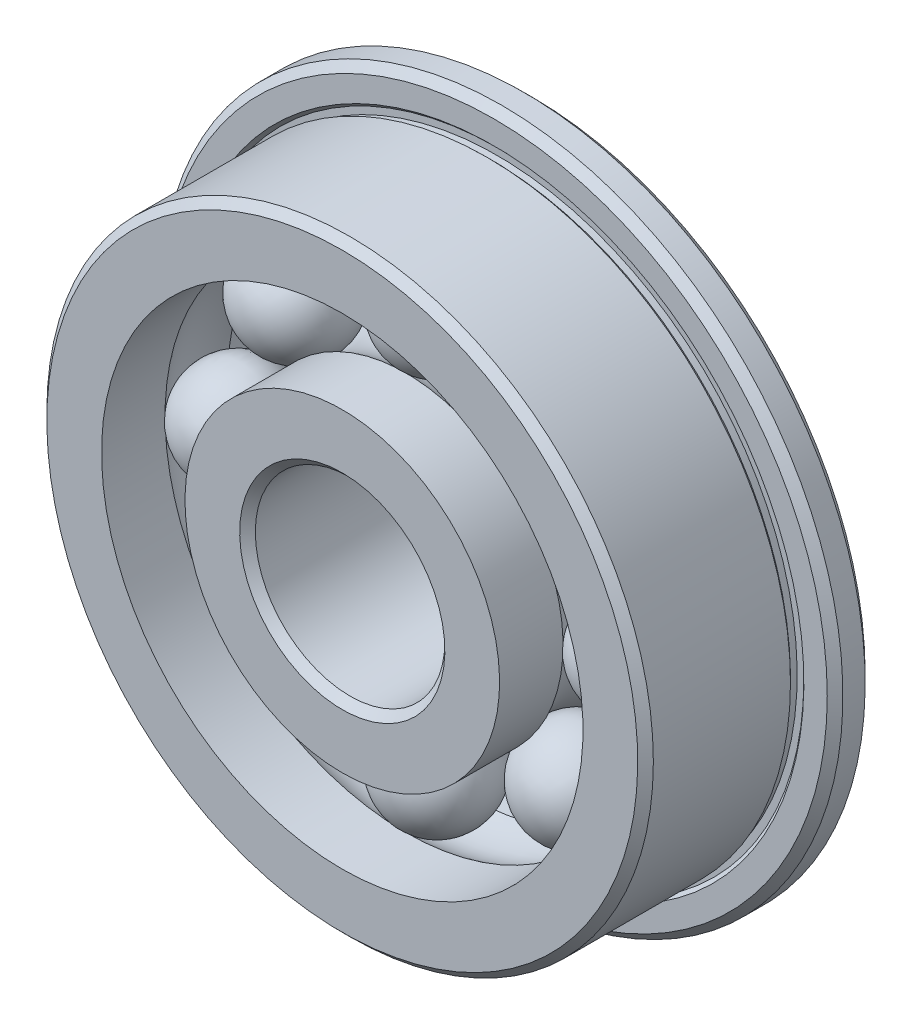
ISO-10303-21;
HEADER;
FILE_DESCRIPTION(('STEP AP214'),'2;1');
FILE_NAME('part.step','',(''),(''),'','','');
FILE_SCHEMA(('AUTOMOTIVE_DESIGN { 1 0 10303 214 1 1 1 1 }'));
ENDSEC;
DATA;
#1=APPLICATION_CONTEXT('core data for automotive mechanical design processes');
#2=APPLICATION_PROTOCOL_DEFINITION('international standard','automotive_design',2000,#1);
#3=PRODUCT_CONTEXT('',#1,'mechanical');
#4=PRODUCT('Part','Part','',(#3));
#5=PRODUCT_RELATED_PRODUCT_CATEGORY('part','',(#4));
#6=PRODUCT_DEFINITION_FORMATION('','',#4);
#7=PRODUCT_DEFINITION_CONTEXT('part definition',#1,'design');
#8=PRODUCT_DEFINITION('design','',#6,#7);
#9=PRODUCT_DEFINITION_SHAPE('','',#8);
#10=(LENGTH_UNIT() NAMED_UNIT(*) SI_UNIT(.MILLI.,.METRE.));
#11=(NAMED_UNIT(*) PLANE_ANGLE_UNIT() SI_UNIT($,.RADIAN.));
#12=(NAMED_UNIT(*) SI_UNIT($,.STERADIAN.) SOLID_ANGLE_UNIT());
#13=UNCERTAINTY_MEASURE_WITH_UNIT(LENGTH_MEASURE(1.E-05),#10,'distance_accuracy_value','');
#14=(GEOMETRIC_REPRESENTATION_CONTEXT(3) GLOBAL_UNCERTAINTY_ASSIGNED_CONTEXT((#13)) GLOBAL_UNIT_ASSIGNED_CONTEXT((#10,
#11,#12)) REPRESENTATION_CONTEXT('',''));
#15=CARTESIAN_POINT('',(0.,0.,0.));
#16=DIRECTION('',(0.,0.,1.));
#17=DIRECTION('',(1.,0.,0.));
#18=AXIS2_PLACEMENT_3D('',#15,#16,#17);
#19=CARTESIAN_POINT('',(-3.71231060122933,3.71231060122942,0.));
#20=DIRECTION('',(-0.707106781186539,0.707106781186556,0.));
#21=DIRECTION('',(0.707106781186556,0.707106781186539,0.));
#22=AXIS2_PLACEMENT_3D('',#19,#20,#21);
#23=SPHERICAL_SURFACE('',#22,1.375);
#24=CARTESIAN_POINT('',(-4.68458242536082,4.68458242536093,0.));
#25=VERTEX_POINT('',#24);
#26=VERTEX_LOOP('',#25);
#27=FACE_BOUND('',#26,.T.);
#28=ADVANCED_FACE('F50',(#27),#23,.T.);
#29=CLOSED_SHELL('',(#28));
#30=MANIFOLD_SOLID_BREP('B2',#29);
#31=CARTESIAN_POINT('',(-5.25,0.,0.));
#32=DIRECTION('',(-1.,0.,0.));
#33=DIRECTION('',(0.,1.,0.));
#34=AXIS2_PLACEMENT_3D('',#31,#32,#33);
#35=SPHERICAL_SURFACE('',#34,1.375);
#36=CARTESIAN_POINT('',(-6.625,0.,0.));
#37=VERTEX_POINT('',#36);
#38=VERTEX_LOOP('',#37);
#39=FACE_BOUND('',#38,.T.);
#40=ADVANCED_FACE('F71',(#39),#35,.T.);
#41=CLOSED_SHELL('',(#40));
#42=MANIFOLD_SOLID_BREP('B7',#41);
#43=CARTESIAN_POINT('',(-3.71231060122941,-3.71231060122934,0.));
#44=DIRECTION('',(-0.707106781186554,-0.707106781186541,0.));
#45=DIRECTION('',(-0.707106781186541,0.707106781186554,0.));
#46=AXIS2_PLACEMENT_3D('',#43,#44,#45);
#47=SPHERICAL_SURFACE('',#46,1.375);
#48=CARTESIAN_POINT('',(-4.68458242536092,-4.68458242536084,0.));
#49=VERTEX_POINT('',#48);
#50=VERTEX_LOOP('',#49);
#51=FACE_BOUND('',#50,.T.);
#52=ADVANCED_FACE('F92',(#51),#47,.T.);
#53=CLOSED_SHELL('',(#52));
#54=MANIFOLD_SOLID_BREP('B46',#53);
#55=CARTESIAN_POINT('',(0.,-5.25,0.));
#56=DIRECTION('',(0.,-1.,0.));
#57=DIRECTION('',(-1.,0.,0.));
#58=AXIS2_PLACEMENT_3D('',#55,#56,#57);
#59=SPHERICAL_SURFACE('',#58,1.375);
#60=CARTESIAN_POINT('',(0.,-6.625,0.));
#61=VERTEX_POINT('',#60);
#62=VERTEX_LOOP('',#61);
#63=FACE_BOUND('',#62,.T.);
#64=ADVANCED_FACE('F113',(#63),#59,.T.);
#65=CLOSED_SHELL('',(#64));
#66=MANIFOLD_SOLID_BREP('B67',#65);
#67=CARTESIAN_POINT('',(3.71231060122935,-3.71231060122939,0.));
#68=DIRECTION('',(0.707106781186544,-0.707106781186551,0.));
#69=DIRECTION('',(-0.707106781186551,-0.707106781186544,0.));
#70=AXIS2_PLACEMENT_3D('',#67,#68,#69);
#71=SPHERICAL_SURFACE('',#70,1.375);
#72=CARTESIAN_POINT('',(4.68458242536085,-4.6845824253609,0.));
#73=VERTEX_POINT('',#72);
#74=VERTEX_LOOP('',#73);
#75=FACE_BOUND('',#74,.T.);
#76=ADVANCED_FACE('F134',(#75),#71,.T.);
#77=CLOSED_SHELL('',(#76));
#78=MANIFOLD_SOLID_BREP('B88',#77);
#79=CARTESIAN_POINT('',(5.25,0.,0.));
#80=DIRECTION('',(1.,0.,0.));
#81=DIRECTION('',(0.,-1.,0.));
#82=AXIS2_PLACEMENT_3D('',#79,#80,#81);
#83=SPHERICAL_SURFACE('',#82,1.375);
#84=CARTESIAN_POINT('',(6.625,0.,0.));
#85=VERTEX_POINT('',#84);
#86=VERTEX_LOOP('',#85);
#87=FACE_BOUND('',#86,.T.);
#88=ADVANCED_FACE('F155',(#87),#83,.T.);
#89=CLOSED_SHELL('',(#88));
#90=MANIFOLD_SOLID_BREP('B109',#89);
#91=CARTESIAN_POINT('',(3.71231060122938,3.71231060122937,0.));
#92=DIRECTION('',(0.707106781186549,0.707106781186546,0.));
#93=DIRECTION('',(0.707106781186546,-0.707106781186549,0.));
#94=AXIS2_PLACEMENT_3D('',#91,#92,#93);
#95=SPHERICAL_SURFACE('',#94,1.375);
#96=CARTESIAN_POINT('',(4.68458242536088,4.68458242536087,0.));
#97=VERTEX_POINT('',#96);
#98=VERTEX_LOOP('',#97);
#99=FACE_BOUND('',#98,.T.);
#100=ADVANCED_FACE('F176',(#99),#95,.T.);
#101=CLOSED_SHELL('',(#100));
#102=MANIFOLD_SOLID_BREP('B130',#101);
#103=CARTESIAN_POINT('',(0.,5.25,0.));
#104=DIRECTION('',(0.,1.,0.));
#105=DIRECTION('',(1.,0.,0.));
#106=AXIS2_PLACEMENT_3D('',#103,#104,#105);
#107=SPHERICAL_SURFACE('',#106,1.375);
#108=CARTESIAN_POINT('',(0.,6.625,0.));
#109=VERTEX_POINT('',#108);
#110=VERTEX_LOOP('',#109);
#111=FACE_BOUND('',#110,.T.);
#112=ADVANCED_FACE('F200',(#111),#107,.T.);
#113=CLOSED_SHELL('',(#112));
#114=MANIFOLD_SOLID_BREP('B151',#113);
#115=CARTESIAN_POINT('',(0.,0.,0.));
#116=DIRECTION('',(0.,0.,1.));
#117=DIRECTION('',(0.,-1.,0.));
#118=AXIS2_PLACEMENT_3D('',#115,#116,#117);
#119=CYLINDRICAL_SURFACE('',#118,4.15);
#120=CARTESIAN_POINT('',(0.,0.,-0.824999999999999));
#121=DIRECTION('',(0.,0.,1.));
#122=DIRECTION('',(0.,-1.,0.));
#123=AXIS2_PLACEMENT_3D('',#120,#121,#122);
#124=CIRCLE('',#123,4.15);
#125=CARTESIAN_POINT('',(0.,-4.15,-0.824999999999999));
#126=VERTEX_POINT('',#125);
#127=EDGE_CURVE('E248',#126,#126,#124,.T.);
#128=ORIENTED_EDGE('',*,*,#127,.F.);
#129=EDGE_LOOP('',(#128));
#130=FACE_BOUND('',#129,.T.);
#131=CARTESIAN_POINT('',(0.,0.,-2.5));
#132=DIRECTION('',(0.,0.,1.));
#133=DIRECTION('',(0.,-1.,0.));
#134=AXIS2_PLACEMENT_3D('',#131,#132,#133);
#135=CIRCLE('',#134,4.15);
#136=CARTESIAN_POINT('',(0.,-4.15,-2.5));
#137=VERTEX_POINT('',#136);
#138=EDGE_CURVE('E260',#137,#137,#135,.T.);
#139=ORIENTED_EDGE('',*,*,#138,.T.);
#140=EDGE_LOOP('',(#139));
#141=FACE_BOUND('',#140,.T.);
#142=ADVANCED_FACE('F222',(#130,#141),#119,.T.);
#143=CARTESIAN_POINT('',(0.,0.,0.));
#144=DIRECTION('',(0.,0.,1.));
#145=DIRECTION('',(0.,-1.,0.));
#146=AXIS2_PLACEMENT_3D('',#143,#144,#145);
#147=TOROIDAL_SURFACE('',#146,5.25,1.375);
#148=CARTESIAN_POINT('',(0.,0.,0.824999999999999));
#149=DIRECTION('',(0.,0.,1.));
#150=DIRECTION('',(0.,-1.,0.));
#151=AXIS2_PLACEMENT_3D('',#148,#149,#150);
#152=CIRCLE('',#151,4.15);
#153=CARTESIAN_POINT('',(0.,-4.15,0.824999999999999));
#154=VERTEX_POINT('',#153);
#155=EDGE_CURVE('E252',#154,#154,#152,.T.);
#156=ORIENTED_EDGE('',*,*,#155,.F.);
#157=EDGE_LOOP('',(#156));
#158=FACE_BOUND('',#157,.T.);
#159=ORIENTED_EDGE('',*,*,#127,.T.);
#160=EDGE_LOOP('',(#159));
#161=FACE_BOUND('',#160,.T.);
#162=ADVANCED_FACE('F281',(#158,#161),#147,.F.);
#163=CARTESIAN_POINT('',(0.,0.,0.));
#164=DIRECTION('',(0.,0.,1.));
#165=DIRECTION('',(0.,-1.,0.));
#166=AXIS2_PLACEMENT_3D('',#163,#164,#165);
#167=CYLINDRICAL_SURFACE('',#166,4.15);
#168=CARTESIAN_POINT('',(0.,0.,2.5));
#169=DIRECTION('',(0.,0.,1.));
#170=DIRECTION('',(0.,-1.,0.));
#171=AXIS2_PLACEMENT_3D('',#168,#169,#170);
#172=CIRCLE('',#171,4.15);
#173=CARTESIAN_POINT('',(0.,-4.15,2.5));
#174=VERTEX_POINT('',#173);
#175=EDGE_CURVE('E256',#174,#174,#172,.T.);
#176=ORIENTED_EDGE('',*,*,#175,.F.);
#177=EDGE_LOOP('',(#176));
#178=FACE_BOUND('',#177,.T.);
#179=ORIENTED_EDGE('',*,*,#155,.T.);
#180=EDGE_LOOP('',(#179));
#181=FACE_BOUND('',#180,.T.);
#182=ADVANCED_FACE('F287',(#178,#181),#167,.T.);
#183=CARTESIAN_POINT('',(0.,2.5,2.5));
#184=DIRECTION('',(0.,0.,-1.));
#185=DIRECTION('',(0.,1.,0.));
#186=AXIS2_PLACEMENT_3D('',#183,#184,#185);
#187=PLANE('',#186);
#188=CARTESIAN_POINT('',(0.,0.,2.5));
#189=DIRECTION('',(0.,0.,-1.));
#190=DIRECTION('',(0.,1.,0.));
#191=AXIS2_PLACEMENT_3D('',#188,#189,#190);
#192=CIRCLE('',#191,2.70625);
#193=CARTESIAN_POINT('',(0.,2.70625,2.5));
#194=VERTEX_POINT('',#193);
#195=EDGE_CURVE('E199',#194,#194,#192,.T.);
#196=ORIENTED_EDGE('',*,*,#195,.T.);
#197=EDGE_LOOP('',(#196));
#198=FACE_BOUND('',#197,.T.);
#199=ORIENTED_EDGE('',*,*,#175,.T.);
#200=EDGE_LOOP('',(#199));
#201=FACE_BOUND('',#200,.T.);
#202=ADVANCED_FACE('F278',(#198,#201),#187,.F.);
#203=CARTESIAN_POINT('',(0.,0.,0.));
#204=DIRECTION('',(0.,0.,1.));
#205=DIRECTION('',(0.,-1.,0.));
#206=AXIS2_PLACEMENT_3D('',#203,#204,#205);
#207=CYLINDRICAL_SURFACE('',#206,2.5);
#208=CARTESIAN_POINT('',(0.,0.,-2.29375));
#209=DIRECTION('',(0.,0.,1.));
#210=DIRECTION('',(0.,-1.,0.));
#211=AXIS2_PLACEMENT_3D('',#208,#209,#210);
#212=CIRCLE('',#211,2.5);
#213=CARTESIAN_POINT('',(0.,-2.5,-2.29375));
#214=VERTEX_POINT('',#213);
#215=EDGE_CURVE('E230',#214,#214,#212,.F.);
#216=ORIENTED_EDGE('',*,*,#215,.T.);
#217=EDGE_LOOP('',(#216));
#218=FACE_BOUND('',#217,.T.);
#219=CARTESIAN_POINT('',(0.,0.,2.29375));
#220=DIRECTION('',(0.,0.,-1.));
#221=DIRECTION('',(0.,1.,0.));
#222=AXIS2_PLACEMENT_3D('',#219,#220,#221);
#223=CIRCLE('',#222,2.5);
#224=CARTESIAN_POINT('',(0.,2.5,2.29375));
#225=VERTEX_POINT('',#224);
#226=EDGE_CURVE('E236',#225,#225,#223,.F.);
#227=ORIENTED_EDGE('',*,*,#226,.T.);
#228=EDGE_LOOP('',(#227));
#229=FACE_BOUND('',#228,.T.);
#230=ADVANCED_FACE('F270',(#218,#229),#207,.F.);
#231=CARTESIAN_POINT('',(0.,4.15,-2.5));
#232=DIRECTION('',(0.,0.,1.));
#233=DIRECTION('',(0.,-1.,0.));
#234=AXIS2_PLACEMENT_3D('',#231,#232,#233);
#235=PLANE('',#234);
#236=CARTESIAN_POINT('',(0.,0.,-2.5));
#237=DIRECTION('',(0.,0.,1.));
#238=DIRECTION('',(0.,-1.,0.));
#239=AXIS2_PLACEMENT_3D('',#236,#237,#238);
#240=CIRCLE('',#239,2.70625);
#241=CARTESIAN_POINT('',(0.,-2.70625,-2.5));
#242=VERTEX_POINT('',#241);
#243=EDGE_CURVE('E242',#242,#242,#240,.T.);
#244=ORIENTED_EDGE('',*,*,#243,.T.);
#245=EDGE_LOOP('',(#244));
#246=FACE_BOUND('',#245,.T.);
#247=ORIENTED_EDGE('',*,*,#138,.F.);
#248=EDGE_LOOP('',(#247));
#249=FACE_BOUND('',#248,.T.);
#250=ADVANCED_FACE('F267',(#246,#249),#235,.F.);
#251=CARTESIAN_POINT('',(0.,0.,-2.5));
#252=DIRECTION('',(0.,0.,-1.));
#253=DIRECTION('',(0.,1.,0.));
#254=AXIS2_PLACEMENT_3D('',#251,#252,#253);
#255=CONICAL_SURFACE('',#254,2.70625,0.785398163397448);
#256=ORIENTED_EDGE('',*,*,#215,.F.);
#257=EDGE_LOOP('',(#256));
#258=FACE_BOUND('',#257,.T.);
#259=ORIENTED_EDGE('',*,*,#243,.F.);
#260=EDGE_LOOP('',(#259));
#261=FACE_BOUND('',#260,.T.);
#262=ADVANCED_FACE('F269',(#258,#261),#255,.F.);
#263=CARTESIAN_POINT('',(0.,0.,2.29375));
#264=DIRECTION('',(0.,0.,1.));
#265=DIRECTION('',(0.,-1.,0.));
#266=AXIS2_PLACEMENT_3D('',#263,#264,#265);
#267=CONICAL_SURFACE('',#266,2.5,0.785398163397448);
#268=ORIENTED_EDGE('',*,*,#195,.F.);
#269=EDGE_LOOP('',(#268));
#270=FACE_BOUND('',#269,.T.);
#271=ORIENTED_EDGE('',*,*,#226,.F.);
#272=EDGE_LOOP('',(#271));
#273=FACE_BOUND('',#272,.T.);
#274=ADVANCED_FACE('F224',(#270,#273),#267,.F.);
#275=CLOSED_SHELL('',(#142,#162,#182,#202,#230,#250,#262,#274));
#276=MANIFOLD_SOLID_BREP('B172',#275);
#277=CARTESIAN_POINT('',(0.,6.35,-2.5));
#278=DIRECTION('',(0.,0.,1.));
#279=DIRECTION('',(0.,-1.,0.));
#280=AXIS2_PLACEMENT_3D('',#277,#278,#279);
#281=PLANE('',#280);
#282=CARTESIAN_POINT('',(0.,0.,-2.5));
#283=DIRECTION('',(0.,0.,1.));
#284=DIRECTION('',(0.,-1.,0.));
#285=AXIS2_PLACEMENT_3D('',#282,#283,#284);
#286=CIRCLE('',#285,8.79375);
#287=CARTESIAN_POINT('',(0.,-8.79375,-2.5));
#288=VERTEX_POINT('',#287);
#289=EDGE_CURVE('E381',#288,#288,#286,.F.);
#290=ORIENTED_EDGE('',*,*,#289,.T.);
#291=EDGE_LOOP('',(#290));
#292=FACE_BOUND('',#291,.T.);
#293=CARTESIAN_POINT('',(0.,0.,-2.5));
#294=DIRECTION('',(0.,0.,1.));
#295=DIRECTION('',(0.,-1.,0.));
#296=AXIS2_PLACEMENT_3D('',#293,#294,#295);
#297=CIRCLE('',#296,6.35);
#298=CARTESIAN_POINT('',(0.,-6.35,-2.5));
#299=VERTEX_POINT('',#298);
#300=EDGE_CURVE('E395',#299,#299,#297,.T.);
#301=ORIENTED_EDGE('',*,*,#300,.T.);
#302=EDGE_LOOP('',(#301));
#303=FACE_BOUND('',#302,.T.);
#304=ADVANCED_FACE('F361',(#292,#303),#281,.F.);
#305=CARTESIAN_POINT('',(0.,0.,0.));
#306=DIRECTION('',(0.,0.,1.));
#307=DIRECTION('',(0.,-1.,0.));
#308=AXIS2_PLACEMENT_3D('',#305,#306,#307);
#309=CYLINDRICAL_SURFACE('',#308,6.35);
#310=ORIENTED_EDGE('',*,*,#300,.F.);
#311=EDGE_LOOP('',(#310));
#312=FACE_BOUND('',#311,.T.);
#313=CARTESIAN_POINT('',(0.,0.,-0.824999999999999));
#314=DIRECTION('',(0.,0.,1.));
#315=DIRECTION('',(0.,-1.,0.));
#316=AXIS2_PLACEMENT_3D('',#313,#314,#315);
#317=CIRCLE('',#316,6.35);
#318=CARTESIAN_POINT('',(0.,-6.35,-0.825));
#319=VERTEX_POINT('',#318);
#320=EDGE_CURVE('E399',#319,#319,#317,.T.);
#321=ORIENTED_EDGE('',*,*,#320,.T.);
#322=EDGE_LOOP('',(#321));
#323=FACE_BOUND('',#322,.T.);
#324=ADVANCED_FACE('F451',(#312,#323),#309,.F.);
#325=CARTESIAN_POINT('',(0.,0.,0.));
#326=DIRECTION('',(0.,0.,1.));
#327=DIRECTION('',(0.,-1.,0.));
#328=AXIS2_PLACEMENT_3D('',#325,#326,#327);
#329=TOROIDAL_SURFACE('',#328,5.25,1.375);
#330=ORIENTED_EDGE('',*,*,#320,.F.);
#331=EDGE_LOOP('',(#330));
#332=FACE_BOUND('',#331,.T.);
#333=CARTESIAN_POINT('',(0.,0.,0.824999999999999));
#334=DIRECTION('',(0.,0.,1.));
#335=DIRECTION('',(0.,-1.,0.));
#336=AXIS2_PLACEMENT_3D('',#333,#334,#335);
#337=CIRCLE('',#336,6.35);
#338=CARTESIAN_POINT('',(0.,-6.35,0.824999999999999));
#339=VERTEX_POINT('',#338);
#340=EDGE_CURVE('E403',#339,#339,#337,.T.);
#341=ORIENTED_EDGE('',*,*,#340,.T.);
#342=EDGE_LOOP('',(#341));
#343=FACE_BOUND('',#342,.T.);
#344=ADVANCED_FACE('F457',(#332,#343),#329,.F.);
#345=CARTESIAN_POINT('',(0.,0.,0.));
#346=DIRECTION('',(0.,0.,1.));
#347=DIRECTION('',(0.,-1.,0.));
#348=AXIS2_PLACEMENT_3D('',#345,#346,#347);
#349=CYLINDRICAL_SURFACE('',#348,6.35);
#350=ORIENTED_EDGE('',*,*,#340,.F.);
#351=EDGE_LOOP('',(#350));
#352=FACE_BOUND('',#351,.T.);
#353=CARTESIAN_POINT('',(0.,0.,2.5));
#354=DIRECTION('',(0.,0.,1.));
#355=DIRECTION('',(0.,-1.,0.));
#356=AXIS2_PLACEMENT_3D('',#353,#354,#355);
#357=CIRCLE('',#356,6.35);
#358=CARTESIAN_POINT('',(0.,-6.35,2.5));
#359=VERTEX_POINT('',#358);
#360=EDGE_CURVE('E407',#359,#359,#357,.T.);
#361=ORIENTED_EDGE('',*,*,#360,.T.);
#362=EDGE_LOOP('',(#361));
#363=FACE_BOUND('',#362,.T.);
#364=ADVANCED_FACE('F521',(#352,#363),#349,.F.);
#365=CARTESIAN_POINT('',(0.,8.,2.5));
#366=DIRECTION('',(0.,0.,-1.));
#367=DIRECTION('',(0.,1.,0.));
#368=AXIS2_PLACEMENT_3D('',#365,#366,#367);
#369=PLANE('',#368);
#370=CARTESIAN_POINT('',(0.,0.,2.5));
#371=DIRECTION('',(0.,0.,-1.));
#372=DIRECTION('',(0.,1.,0.));
#373=AXIS2_PLACEMENT_3D('',#370,#371,#372);
#374=CIRCLE('',#373,7.79375);
#375=CARTESIAN_POINT('',(0.,7.79375,2.5));
#376=VERTEX_POINT('',#375);
#377=EDGE_CURVE('E369',#376,#376,#374,.F.);
#378=ORIENTED_EDGE('',*,*,#377,.T.);
#379=EDGE_LOOP('',(#378));
#380=FACE_BOUND('',#379,.T.);
#381=ORIENTED_EDGE('',*,*,#360,.F.);
#382=EDGE_LOOP('',(#381));
#383=FACE_BOUND('',#382,.T.);
#384=ADVANCED_FACE('F511',(#380,#383),#369,.F.);
#385=CARTESIAN_POINT('',(0.,0.,0.));
#386=DIRECTION('',(0.,0.,1.));
#387=DIRECTION('',(0.,-1.,0.));
#388=AXIS2_PLACEMENT_3D('',#385,#386,#387);
#389=CYLINDRICAL_SURFACE('',#388,8.);
#390=CARTESIAN_POINT('',(0.,0.,2.29375));
#391=DIRECTION('',(0.,0.,-1.));
#392=DIRECTION('',(0.,1.,0.));
#393=AXIS2_PLACEMENT_3D('',#390,#391,#392);
#394=CIRCLE('',#393,8.);
#395=CARTESIAN_POINT('',(0.,8.,2.29375));
#396=VERTEX_POINT('',#395);
#397=EDGE_CURVE('E221',#396,#396,#394,.T.);
#398=ORIENTED_EDGE('',*,*,#397,.T.);
#399=EDGE_LOOP('',(#398));
#400=FACE_BOUND('',#399,.T.);
#401=CARTESIAN_POINT('',(0.,0.,-1.32322330470336));
#402=DIRECTION('',(0.,0.,1.));
#403=DIRECTION('',(0.,-1.,0.));
#404=AXIS2_PLACEMENT_3D('',#401,#402,#403);
#405=CIRCLE('',#404,8.);
#406=CARTESIAN_POINT('',(0.,-8.,-1.32322330470336));
#407=VERTEX_POINT('',#406);
#408=EDGE_CURVE('E411',#407,#407,#405,.T.);
#409=ORIENTED_EDGE('',*,*,#408,.T.);
#410=EDGE_LOOP('',(#409));
#411=FACE_BOUND('',#410,.T.);
#412=ADVANCED_FACE('F505',(#400,#411),#389,.T.);
#413=CARTESIAN_POINT('',(0.,0.,-1.41161165235168));
#414=DIRECTION('',(0.,0.,1.));
#415=DIRECTION('',(0.,-1.,0.));
#416=AXIS2_PLACEMENT_3D('',#413,#414,#415);
#417=CONICAL_SURFACE('',#416,7.91161165235168,0.785398163397432);
#418=ORIENTED_EDGE('',*,*,#408,.F.);
#419=EDGE_LOOP('',(#418));
#420=FACE_BOUND('',#419,.T.);
#421=CARTESIAN_POINT('',(0.,0.,-1.41161165235168));
#422=DIRECTION('',(0.,0.,1.));
#423=DIRECTION('',(0.,-1.,0.));
#424=AXIS2_PLACEMENT_3D('',#421,#422,#423);
#425=CIRCLE('',#424,7.91161165235168);
#426=CARTESIAN_POINT('',(0.,-7.91161165235168,-1.41161165235168));
#427=VERTEX_POINT('',#426);
#428=EDGE_CURVE('E415',#427,#427,#425,.T.);
#429=ORIENTED_EDGE('',*,*,#428,.T.);
#430=EDGE_LOOP('',(#429));
#431=FACE_BOUND('',#430,.T.);
#432=ADVANCED_FACE('F510',(#420,#431),#417,.T.);
#433=CARTESIAN_POINT('',(0.,0.,0.));
#434=DIRECTION('',(0.,0.,1.));
#435=DIRECTION('',(0.,-1.,0.));
#436=AXIS2_PLACEMENT_3D('',#433,#434,#435);
#437=CYLINDRICAL_SURFACE('',#436,7.91161165235168);
#438=ORIENTED_EDGE('',*,*,#428,.F.);
#439=EDGE_LOOP('',(#438));
#440=FACE_BOUND('',#439,.T.);
#441=CARTESIAN_POINT('',(0.,0.,-1.58838834764832));
#442=DIRECTION('',(0.,0.,1.));
#443=DIRECTION('',(0.,-1.,0.));
#444=AXIS2_PLACEMENT_3D('',#441,#442,#443);
#445=CIRCLE('',#444,7.91161165235168);
#446=CARTESIAN_POINT('',(0.,-7.91161165235168,-1.58838834764832));
#447=VERTEX_POINT('',#446);
#448=EDGE_CURVE('E419',#447,#447,#445,.T.);
#449=ORIENTED_EDGE('',*,*,#448,.T.);
#450=EDGE_LOOP('',(#449));
#451=FACE_BOUND('',#450,.T.);
#452=ADVANCED_FACE('F543',(#440,#451),#437,.T.);
#453=CARTESIAN_POINT('',(0.,8.08838834764832,-1.58838834764832));
#454=DIRECTION('',(0.,0.,-1.));
#455=DIRECTION('',(0.,1.,0.));
#456=AXIS2_PLACEMENT_3D('',#453,#454,#455);
#457=PLANE('',#456);
#458=ORIENTED_EDGE('',*,*,#448,.F.);
#459=EDGE_LOOP('',(#458));
#460=FACE_BOUND('',#459,.T.);
#461=CARTESIAN_POINT('',(0.,0.,-1.58838834764832));
#462=DIRECTION('',(0.,0.,1.));
#463=DIRECTION('',(0.,-1.,0.));
#464=AXIS2_PLACEMENT_3D('',#461,#462,#463);
#465=CIRCLE('',#464,8.08838834764832);
#466=CARTESIAN_POINT('',(0.,-8.08838834764832,-1.58838834764832));
#467=VERTEX_POINT('',#466);
#468=EDGE_CURVE('E423',#467,#467,#465,.T.);
#469=ORIENTED_EDGE('',*,*,#468,.T.);
#470=EDGE_LOOP('',(#469));
#471=FACE_BOUND('',#470,.T.);
#472=ADVANCED_FACE('F447',(#460,#471),#457,.F.);
#473=CARTESIAN_POINT('',(0.,0.,-1.5));
#474=DIRECTION('',(0.,0.,1.));
#475=DIRECTION('',(0.,-1.,0.));
#476=AXIS2_PLACEMENT_3D('',#473,#474,#475);
#477=CONICAL_SURFACE('',#476,8.17677669529664,0.785398163397437);
#478=ORIENTED_EDGE('',*,*,#468,.F.);
#479=EDGE_LOOP('',(#478));
#480=FACE_BOUND('',#479,.T.);
#481=CARTESIAN_POINT('',(0.,0.,-1.5));
#482=DIRECTION('',(0.,0.,1.));
#483=DIRECTION('',(0.,-1.,0.));
#484=AXIS2_PLACEMENT_3D('',#481,#482,#483);
#485=CIRCLE('',#484,8.17677669529664);
#486=CARTESIAN_POINT('',(0.,-8.17677669529664,-1.5));
#487=VERTEX_POINT('',#486);
#488=EDGE_CURVE('E427',#487,#487,#485,.T.);
#489=ORIENTED_EDGE('',*,*,#488,.T.);
#490=EDGE_LOOP('',(#489));
#491=FACE_BOUND('',#490,.T.);
#492=ADVANCED_FACE('F433',(#480,#491),#477,.F.);
#493=CARTESIAN_POINT('',(0.,9.,-1.5));
#494=DIRECTION('',(0.,0.,-1.));
#495=DIRECTION('',(0.,1.,0.));
#496=AXIS2_PLACEMENT_3D('',#493,#494,#495);
#497=PLANE('',#496);
#498=CARTESIAN_POINT('',(0.,0.,-1.5));
#499=DIRECTION('',(0.,0.,-1.));
#500=DIRECTION('',(0.,1.,0.));
#501=AXIS2_PLACEMENT_3D('',#498,#499,#500);
#502=CIRCLE('',#501,8.79375);
#503=CARTESIAN_POINT('',(0.,8.79375,-1.5));
#504=VERTEX_POINT('',#503);
#505=EDGE_CURVE('E375',#504,#504,#502,.F.);
#506=ORIENTED_EDGE('',*,*,#505,.T.);
#507=EDGE_LOOP('',(#506));
#508=FACE_BOUND('',#507,.T.);
#509=ORIENTED_EDGE('',*,*,#488,.F.);
#510=EDGE_LOOP('',(#509));
#511=FACE_BOUND('',#510,.T.);
#512=ADVANCED_FACE('F435',(#508,#511),#497,.F.);
#513=CARTESIAN_POINT('',(0.,0.,0.));
#514=DIRECTION('',(0.,0.,1.));
#515=DIRECTION('',(0.,-1.,0.));
#516=AXIS2_PLACEMENT_3D('',#513,#514,#515);
#517=CYLINDRICAL_SURFACE('',#516,9.);
#518=CARTESIAN_POINT('',(0.,0.,-2.29375));
#519=DIRECTION('',(0.,0.,1.));
#520=DIRECTION('',(0.,-1.,0.));
#521=AXIS2_PLACEMENT_3D('',#518,#519,#520);
#522=CIRCLE('',#521,9.);
#523=CARTESIAN_POINT('',(0.,-9.,-2.29375));
#524=VERTEX_POINT('',#523);
#525=EDGE_CURVE('E387',#524,#524,#522,.T.);
#526=ORIENTED_EDGE('',*,*,#525,.T.);
#527=EDGE_LOOP('',(#526));
#528=FACE_BOUND('',#527,.T.);
#529=CARTESIAN_POINT('',(0.,0.,-1.70625));
#530=DIRECTION('',(0.,0.,-1.));
#531=DIRECTION('',(0.,1.,0.));
#532=AXIS2_PLACEMENT_3D('',#529,#530,#531);
#533=CIRCLE('',#532,9.);
#534=CARTESIAN_POINT('',(0.,9.,-1.70625));
#535=VERTEX_POINT('',#534);
#536=EDGE_CURVE('E391',#535,#535,#533,.T.);
#537=ORIENTED_EDGE('',*,*,#536,.T.);
#538=EDGE_LOOP('',(#537));
#539=FACE_BOUND('',#538,.T.);
#540=ADVANCED_FACE('F437',(#528,#539),#517,.T.);
#541=CARTESIAN_POINT('',(0.,0.,-2.29375));
#542=DIRECTION('',(0.,0.,1.));
#543=DIRECTION('',(0.,-1.,0.));
#544=AXIS2_PLACEMENT_3D('',#541,#542,#543);
#545=CONICAL_SURFACE('',#544,9.,0.785398163397448);
#546=ORIENTED_EDGE('',*,*,#289,.F.);
#547=EDGE_LOOP('',(#546));
#548=FACE_BOUND('',#547,.T.);
#549=ORIENTED_EDGE('',*,*,#525,.F.);
#550=EDGE_LOOP('',(#549));
#551=FACE_BOUND('',#550,.T.);
#552=ADVANCED_FACE('F444',(#548,#551),#545,.T.);
#553=CARTESIAN_POINT('',(0.,0.,-1.5));
#554=DIRECTION('',(0.,0.,-1.));
#555=DIRECTION('',(0.,1.,0.));
#556=AXIS2_PLACEMENT_3D('',#553,#554,#555);
#557=CONICAL_SURFACE('',#556,8.79375,0.785398163397448);
#558=ORIENTED_EDGE('',*,*,#536,.F.);
#559=EDGE_LOOP('',(#558));
#560=FACE_BOUND('',#559,.T.);
#561=ORIENTED_EDGE('',*,*,#505,.F.);
#562=EDGE_LOOP('',(#561));
#563=FACE_BOUND('',#562,.T.);
#564=ADVANCED_FACE('F464',(#560,#563),#557,.T.);
#565=CARTESIAN_POINT('',(0.,0.,2.5));
#566=DIRECTION('',(0.,0.,-1.));
#567=DIRECTION('',(0.,1.,0.));
#568=AXIS2_PLACEMENT_3D('',#565,#566,#567);
#569=CONICAL_SURFACE('',#568,7.79375,0.785398163397448);
#570=ORIENTED_EDGE('',*,*,#397,.F.);
#571=EDGE_LOOP('',(#570));
#572=FACE_BOUND('',#571,.T.);
#573=ORIENTED_EDGE('',*,*,#377,.F.);
#574=EDGE_LOOP('',(#573));
#575=FACE_BOUND('',#574,.T.);
#576=ADVANCED_FACE('F363',(#572,#575),#569,.T.);
#577=CLOSED_SHELL('',(#304,#324,#344,#364,#384,#412,#432,#452,#472,#492,#512,#540,#552,#564,#576));
#578=MANIFOLD_SOLID_BREP('B194',#577);
#579=ADVANCED_BREP_SHAPE_REPRESENTATION('',(#18,#30,#42,#54,#66,#78,#90,#102,#114,#276,#578),#14);
#580=SHAPE_DEFINITION_REPRESENTATION(#9,#579);
ENDSEC;
END-ISO-10303-21;
